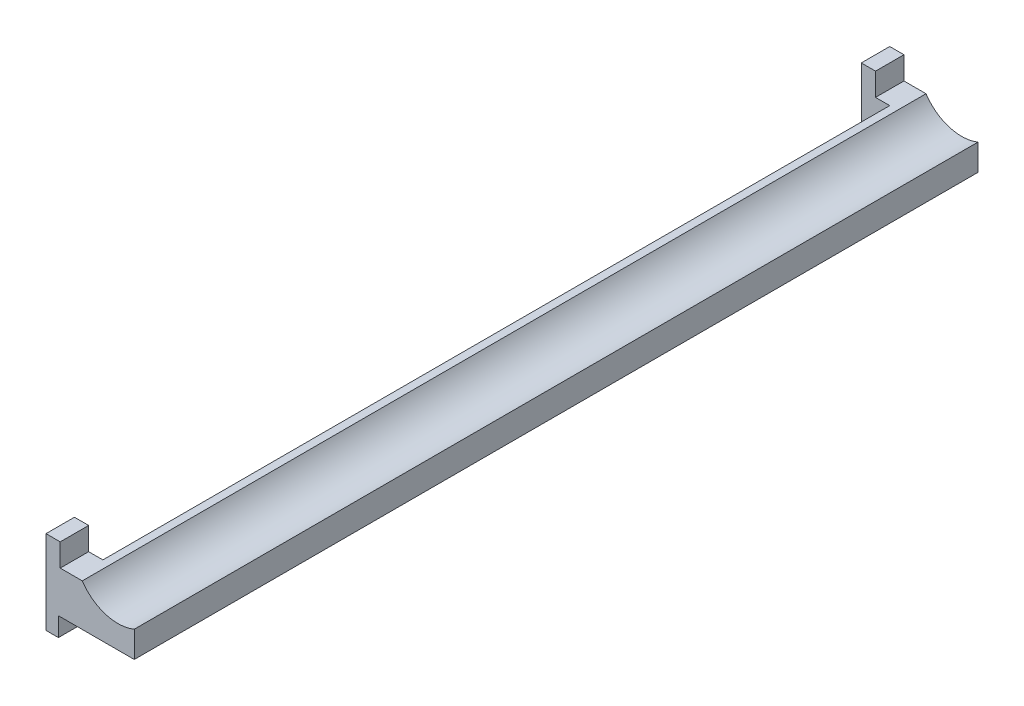
ISO-10303-21;
HEADER;
FILE_DESCRIPTION(('STEP AP214'),'2;1');
FILE_NAME('part.step','',(''),(''),'','','');
FILE_SCHEMA(('AUTOMOTIVE_DESIGN { 1 0 10303 214 1 1 1 1 }'));
ENDSEC;
DATA;
#1=APPLICATION_CONTEXT('core data for automotive mechanical design processes');
#2=APPLICATION_PROTOCOL_DEFINITION('international standard','automotive_design',2000,#1);
#3=PRODUCT_CONTEXT('',#1,'mechanical');
#4=PRODUCT('Part','Part','',(#3));
#5=PRODUCT_RELATED_PRODUCT_CATEGORY('part','',(#4));
#6=PRODUCT_DEFINITION_FORMATION('','',#4);
#7=PRODUCT_DEFINITION_CONTEXT('part definition',#1,'design');
#8=PRODUCT_DEFINITION('design','',#6,#7);
#9=PRODUCT_DEFINITION_SHAPE('','',#8);
#10=(LENGTH_UNIT() NAMED_UNIT(*) SI_UNIT(.MILLI.,.METRE.));
#11=(NAMED_UNIT(*) PLANE_ANGLE_UNIT() SI_UNIT($,.RADIAN.));
#12=(NAMED_UNIT(*) SI_UNIT($,.STERADIAN.) SOLID_ANGLE_UNIT());
#13=UNCERTAINTY_MEASURE_WITH_UNIT(LENGTH_MEASURE(1.E-05),#10,'distance_accuracy_value','');
#14=(GEOMETRIC_REPRESENTATION_CONTEXT(3) GLOBAL_UNCERTAINTY_ASSIGNED_CONTEXT((#13)) GLOBAL_UNIT_ASSIGNED_CONTEXT((#10,
#11,#12)) REPRESENTATION_CONTEXT('',''));
#15=CARTESIAN_POINT('',(0.,0.,0.));
#16=DIRECTION('',(0.,0.,1.));
#17=DIRECTION('',(1.,0.,0.));
#18=AXIS2_PLACEMENT_3D('',#15,#16,#17);
#19=CARTESIAN_POINT('',(187.42,44.22,-890.));
#20=DIRECTION('',(0.,1.,0.));
#21=DIRECTION('',(0.,0.,1.));
#22=AXIS2_PLACEMENT_3D('',#19,#20,#21);
#23=PLANE('',#22);
#24=DIRECTION('',(-1.,0.,0.));
#25=VECTOR('',#24,1.);
#26=CARTESIAN_POINT('',(217.42,44.22,-30.));
#27=LINE('',#26,#25);
#28=CARTESIAN_POINT('',(202.42,44.22,-30.));
#29=VERTEX_POINT('',#28);
#30=CARTESIAN_POINT('',(187.42,44.22,-30.));
#31=VERTEX_POINT('',#30);
#32=EDGE_CURVE('E209',#29,#31,#27,.T.);
#33=ORIENTED_EDGE('',*,*,#32,.T.);
#34=DIRECTION('',(0.,0.,1.));
#35=VECTOR('',#34,1.);
#36=CARTESIAN_POINT('',(187.42,44.22,-890.));
#37=LINE('',#36,#35);
#38=CARTESIAN_POINT('',(187.42,44.22,0.));
#39=VERTEX_POINT('',#38);
#40=EDGE_CURVE('E159',#31,#39,#37,.T.);
#41=ORIENTED_EDGE('',*,*,#40,.T.);
#42=DIRECTION('',(-1.,0.,0.));
#43=VECTOR('',#42,1.);
#44=CARTESIAN_POINT('',(187.42,44.22,0.));
#45=LINE('',#44,#43);
#46=CARTESIAN_POINT('',(202.42,44.22,0.));
#47=VERTEX_POINT('',#46);
#48=EDGE_CURVE('E160',#47,#39,#45,.T.);
#49=ORIENTED_EDGE('',*,*,#48,.F.);
#50=DIRECTION('',(0.,0.,1.));
#51=VECTOR('',#50,1.);
#52=CARTESIAN_POINT('',(202.42,44.22,-890.));
#53=LINE('',#52,#51);
#54=EDGE_CURVE('E96',#29,#47,#53,.T.);
#55=ORIENTED_EDGE('',*,*,#54,.F.);
#56=EDGE_LOOP('',(#33,#41,#49,#55));
#57=FACE_BOUND('',#56,.T.);
#58=ADVANCED_FACE('F36',(#57),#23,.T.);
#59=CARTESIAN_POINT('',(202.42,20.22,-890.));
#60=DIRECTION('',(1.,0.,0.));
#61=DIRECTION('',(0.,0.,-1.));
#62=AXIS2_PLACEMENT_3D('',#59,#60,#61);
#63=PLANE('',#62);
#64=DIRECTION('',(0.,-1.,0.));
#65=VECTOR('',#64,1.);
#66=CARTESIAN_POINT('',(202.42,20.22,-30.));
#67=LINE('',#66,#65);
#68=CARTESIAN_POINT('',(202.42,20.22,-30.));
#69=VERTEX_POINT('',#68);
#70=EDGE_CURVE('E221',#29,#69,#67,.T.);
#71=ORIENTED_EDGE('',*,*,#70,.F.);
#72=ORIENTED_EDGE('',*,*,#54,.T.);
#73=DIRECTION('',(0.,1.,0.));
#74=VECTOR('',#73,1.);
#75=CARTESIAN_POINT('',(202.42,20.22,0.));
#76=LINE('',#75,#74);
#77=CARTESIAN_POINT('',(202.42,20.22,0.));
#78=VERTEX_POINT('',#77);
#79=EDGE_CURVE('E182',#78,#47,#76,.T.);
#80=ORIENTED_EDGE('',*,*,#79,.F.);
#81=DIRECTION('',(0.,0.,1.));
#82=VECTOR('',#81,1.);
#83=CARTESIAN_POINT('',(202.42,20.22,-890.));
#84=LINE('',#83,#82);
#85=EDGE_CURVE('E139',#69,#78,#84,.T.);
#86=ORIENTED_EDGE('',*,*,#85,.F.);
#87=EDGE_LOOP('',(#71,#72,#80,#86));
#88=FACE_BOUND('',#87,.T.);
#89=ADVANCED_FACE('F218',(#88),#63,.T.);
#90=CARTESIAN_POINT('',(200.518812379858,-44.22,-890.));
#91=DIRECTION('',(1.,0.,0.));
#92=DIRECTION('',(0.,0.,-1.));
#93=AXIS2_PLACEMENT_3D('',#90,#91,#92);
#94=PLANE('',#93);
#95=DIRECTION('',(0.,-1.,0.));
#96=VECTOR('',#95,1.);
#97=CARTESIAN_POINT('',(200.518812379858,-44.22,-30.));
#98=LINE('',#97,#96);
#99=CARTESIAN_POINT('',(200.518812379858,-24.22,-30.));
#100=VERTEX_POINT('',#99);
#101=CARTESIAN_POINT('',(200.518812379858,-44.22,-30.));
#102=VERTEX_POINT('',#101);
#103=EDGE_CURVE('E236',#100,#102,#98,.T.);
#104=ORIENTED_EDGE('',*,*,#103,.F.);
#105=DIRECTION('',(0.,0.,1.));
#106=VECTOR('',#105,1.);
#107=CARTESIAN_POINT('',(200.518812379858,-24.22,-890.));
#108=LINE('',#107,#106);
#109=CARTESIAN_POINT('',(200.518812379858,-24.22,0.));
#110=VERTEX_POINT('',#109);
#111=EDGE_CURVE('E195',#100,#110,#108,.T.);
#112=ORIENTED_EDGE('',*,*,#111,.T.);
#113=DIRECTION('',(0.,1.,0.));
#114=VECTOR('',#113,1.);
#115=CARTESIAN_POINT('',(200.518812379858,-44.22,0.));
#116=LINE('',#115,#114);
#117=CARTESIAN_POINT('',(200.518812379858,-44.22,0.));
#118=VERTEX_POINT('',#117);
#119=EDGE_CURVE('E170',#118,#110,#116,.T.);
#120=ORIENTED_EDGE('',*,*,#119,.F.);
#121=DIRECTION('',(0.,0.,1.));
#122=VECTOR('',#121,1.);
#123=CARTESIAN_POINT('',(200.518812379858,-44.22,-890.));
#124=LINE('',#123,#122);
#125=EDGE_CURVE('E199',#102,#118,#124,.T.);
#126=ORIENTED_EDGE('',*,*,#125,.F.);
#127=EDGE_LOOP('',(#104,#112,#120,#126));
#128=FACE_BOUND('',#127,.T.);
#129=ADVANCED_FACE('F298',(#128),#94,.T.);
#130=CARTESIAN_POINT('',(187.42,-44.22,-890.));
#131=DIRECTION('',(0.,-1.,0.));
#132=DIRECTION('',(0.,0.,-1.));
#133=AXIS2_PLACEMENT_3D('',#130,#131,#132);
#134=PLANE('',#133);
#135=DIRECTION('',(-1.,0.,0.));
#136=VECTOR('',#135,1.);
#137=CARTESIAN_POINT('',(217.42,-44.22,-30.));
#138=LINE('',#137,#136);
#139=CARTESIAN_POINT('',(187.42,-44.22,-30.));
#140=VERTEX_POINT('',#139);
#141=EDGE_CURVE('E304',#102,#140,#138,.T.);
#142=ORIENTED_EDGE('',*,*,#141,.F.);
#143=ORIENTED_EDGE('',*,*,#125,.T.);
#144=DIRECTION('',(1.,0.,0.));
#145=VECTOR('',#144,1.);
#146=CARTESIAN_POINT('',(187.42,-44.22,0.));
#147=LINE('',#146,#145);
#148=CARTESIAN_POINT('',(187.42,-44.22,0.));
#149=VERTEX_POINT('',#148);
#150=EDGE_CURVE('E167',#149,#118,#147,.T.);
#151=ORIENTED_EDGE('',*,*,#150,.F.);
#152=DIRECTION('',(0.,0.,1.));
#153=VECTOR('',#152,1.);
#154=CARTESIAN_POINT('',(187.42,-44.22,-890.));
#155=LINE('',#154,#153);
#156=EDGE_CURVE('E202',#140,#149,#155,.T.);
#157=ORIENTED_EDGE('',*,*,#156,.F.);
#158=EDGE_LOOP('',(#142,#143,#151,#157));
#159=FACE_BOUND('',#158,.T.);
#160=ADVANCED_FACE('F302',(#159),#134,.T.);
#161=CARTESIAN_POINT('',(187.42,44.22,-890.));
#162=DIRECTION('',(-1.,0.,0.));
#163=DIRECTION('',(0.,0.,1.));
#164=AXIS2_PLACEMENT_3D('',#161,#162,#163);
#165=PLANE('',#164);
#166=DIRECTION('',(0.,1.,0.));
#167=VECTOR('',#166,1.);
#168=CARTESIAN_POINT('',(187.42,-44.22,-30.));
#169=LINE('',#168,#167);
#170=EDGE_CURVE('E330',#140,#31,#169,.T.);
#171=ORIENTED_EDGE('',*,*,#170,.F.);
#172=ORIENTED_EDGE('',*,*,#156,.T.);
#173=DIRECTION('',(0.,-1.,0.));
#174=VECTOR('',#173,1.);
#175=CARTESIAN_POINT('',(187.42,44.22,0.));
#176=LINE('',#175,#174);
#177=EDGE_CURVE('E163',#39,#149,#176,.T.);
#178=ORIENTED_EDGE('',*,*,#177,.F.);
#179=ORIENTED_EDGE('',*,*,#40,.F.);
#180=EDGE_LOOP('',(#171,#172,#178,#179));
#181=FACE_BOUND('',#180,.T.);
#182=ADVANCED_FACE('F212',(#181),#165,.T.);
#183=DIRECTION('',(-1.,0.,0.));
#184=VECTOR('',#183,1.);
#185=CARTESIAN_POINT('',(217.42,44.22,-860.));
#186=LINE('',#185,#184);
#187=CARTESIAN_POINT('',(202.42,44.22,-860.));
#188=VERTEX_POINT('',#187);
#189=CARTESIAN_POINT('',(187.42,44.22,-860.));
#190=VERTEX_POINT('',#189);
#191=EDGE_CURVE('E51',#188,#190,#186,.T.);
#192=ORIENTED_EDGE('',*,*,#191,.F.);
#193=CARTESIAN_POINT('',(202.42,44.22,-890.));
#194=VERTEX_POINT('',#193);
#195=EDGE_CURVE('E44',#194,#188,#53,.T.);
#196=ORIENTED_EDGE('',*,*,#195,.F.);
#197=DIRECTION('',(-1.,0.,0.));
#198=VECTOR('',#197,1.);
#199=CARTESIAN_POINT('',(187.42,44.22,-890.));
#200=LINE('',#199,#198);
#201=CARTESIAN_POINT('',(187.42,44.22,-890.));
#202=VERTEX_POINT('',#201);
#203=EDGE_CURVE('E185',#194,#202,#200,.T.);
#204=ORIENTED_EDGE('',*,*,#203,.T.);
#205=EDGE_CURVE('E104',#202,#190,#37,.T.);
#206=ORIENTED_EDGE('',*,*,#205,.T.);
#207=EDGE_LOOP('',(#192,#196,#204,#206));
#208=FACE_BOUND('',#207,.T.);
#209=ADVANCED_FACE('F38',(#208),#23,.T.);
#210=DIRECTION('',(0.,1.,0.));
#211=VECTOR('',#210,1.);
#212=CARTESIAN_POINT('',(202.42,20.22,-860.));
#213=LINE('',#212,#211);
#214=CARTESIAN_POINT('',(202.42,20.22,-860.));
#215=VERTEX_POINT('',#214);
#216=EDGE_CURVE('E300',#215,#188,#213,.T.);
#217=ORIENTED_EDGE('',*,*,#216,.F.);
#218=CARTESIAN_POINT('',(202.42,20.22,-890.));
#219=VERTEX_POINT('',#218);
#220=EDGE_CURVE('E187',#219,#215,#84,.T.);
#221=ORIENTED_EDGE('',*,*,#220,.F.);
#222=DIRECTION('',(0.,1.,0.));
#223=VECTOR('',#222,1.);
#224=CARTESIAN_POINT('',(202.42,20.22,-890.));
#225=LINE('',#224,#223);
#226=EDGE_CURVE('E149',#219,#194,#225,.T.);
#227=ORIENTED_EDGE('',*,*,#226,.T.);
#228=ORIENTED_EDGE('',*,*,#195,.T.);
#229=EDGE_LOOP('',(#217,#221,#227,#228));
#230=FACE_BOUND('',#229,.T.);
#231=ADVANCED_FACE('F323',(#230),#63,.T.);
#232=CARTESIAN_POINT('',(225.687364309729,20.22,-890.));
#233=DIRECTION('',(0.,1.,0.));
#234=DIRECTION('',(-1.,0.,0.));
#235=AXIS2_PLACEMENT_3D('',#232,#233,#234);
#236=PLANE('',#235);
#237=DIRECTION('',(1.,0.,0.));
#238=VECTOR('',#237,1.);
#239=CARTESIAN_POINT('',(225.687364309729,20.22,-30.));
#240=LINE('',#239,#238);
#241=CARTESIAN_POINT('',(217.42,20.22,-30.));
#242=VERTEX_POINT('',#241);
#243=EDGE_CURVE('E225',#69,#242,#240,.T.);
#244=ORIENTED_EDGE('',*,*,#243,.F.);
#245=ORIENTED_EDGE('',*,*,#85,.T.);
#246=DIRECTION('',(-1.,0.,0.));
#247=VECTOR('',#246,1.);
#248=CARTESIAN_POINT('',(225.687364309729,20.22,0.));
#249=LINE('',#248,#247);
#250=CARTESIAN_POINT('',(225.687364309729,20.22,0.));
#251=VERTEX_POINT('',#250);
#252=EDGE_CURVE('E134',#251,#78,#249,.T.);
#253=ORIENTED_EDGE('',*,*,#252,.F.);
#254=DIRECTION('',(0.,0.,1.));
#255=VECTOR('',#254,1.);
#256=CARTESIAN_POINT('',(225.687364309729,20.22,-890.));
#257=LINE('',#256,#255);
#258=CARTESIAN_POINT('',(225.687364309729,20.22,-890.));
#259=VERTEX_POINT('',#258);
#260=EDGE_CURVE('E126',#259,#251,#257,.T.);
#261=ORIENTED_EDGE('',*,*,#260,.F.);
#262=DIRECTION('',(-1.,0.,0.));
#263=VECTOR('',#262,1.);
#264=CARTESIAN_POINT('',(225.687364309729,20.22,-890.));
#265=LINE('',#264,#263);
#266=EDGE_CURVE('E131',#259,#219,#265,.T.);
#267=ORIENTED_EDGE('',*,*,#266,.T.);
#268=ORIENTED_EDGE('',*,*,#220,.T.);
#269=DIRECTION('',(-1.,0.,0.));
#270=VECTOR('',#269,1.);
#271=CARTESIAN_POINT('',(225.687364309729,20.22,-860.));
#272=LINE('',#271,#270);
#273=CARTESIAN_POINT('',(217.42,20.22,-860.));
#274=VERTEX_POINT('',#273);
#275=EDGE_CURVE('E315',#274,#215,#272,.T.);
#276=ORIENTED_EDGE('',*,*,#275,.F.);
#277=DIRECTION('',(0.,0.,1.));
#278=VECTOR('',#277,1.);
#279=CARTESIAN_POINT('',(217.42,20.22,-890.));
#280=LINE('',#279,#278);
#281=EDGE_CURVE('E164',#274,#242,#280,.T.);
#282=ORIENTED_EDGE('',*,*,#281,.T.);
#283=EDGE_LOOP('',(#244,#245,#253,#261,#267,#268,#276,#282));
#284=FACE_BOUND('',#283,.T.);
#285=ADVANCED_FACE('F129',(#284),#236,.T.);
#286=CARTESIAN_POINT('',(263.25,45.,-890.));
#287=DIRECTION('',(0.,0.,1.));
#288=DIRECTION('',(1.,0.,0.));
#289=AXIS2_PLACEMENT_3D('',#286,#287,#288);
#290=CYLINDRICAL_SURFACE('',#289,45.0000000000001);
#291=CARTESIAN_POINT('',(263.25,45.,0.));
#292=DIRECTION('',(0.,0.,-1.));
#293=DIRECTION('',(1.,0.,0.));
#294=AXIS2_PLACEMENT_3D('',#291,#292,#293);
#295=CIRCLE('',#294,45.0000000000001);
#296=CARTESIAN_POINT('',(280.518812379858,3.44535983804874,0.));
#297=VERTEX_POINT('',#296);
#298=EDGE_CURVE('E179',#297,#251,#295,.T.);
#299=ORIENTED_EDGE('',*,*,#298,.F.);
#300=DIRECTION('',(0.,0.,1.));
#301=VECTOR('',#300,1.);
#302=CARTESIAN_POINT('',(280.518812379858,3.44535983804874,-890.));
#303=LINE('',#302,#301);
#304=CARTESIAN_POINT('',(280.518812379858,3.44535983804874,-890.));
#305=VERTEX_POINT('',#304);
#306=EDGE_CURVE('E140',#305,#297,#303,.T.);
#307=ORIENTED_EDGE('',*,*,#306,.F.);
#308=CARTESIAN_POINT('',(263.25,45.,-890.));
#309=DIRECTION('',(0.,0.,-1.));
#310=DIRECTION('',(1.,0.,0.));
#311=AXIS2_PLACEMENT_3D('',#308,#309,#310);
#312=CIRCLE('',#311,45.0000000000001);
#313=EDGE_CURVE('E146',#305,#259,#312,.T.);
#314=ORIENTED_EDGE('',*,*,#313,.T.);
#315=ORIENTED_EDGE('',*,*,#260,.T.);
#316=EDGE_LOOP('',(#299,#307,#314,#315));
#317=FACE_BOUND('',#316,.T.);
#318=ADVANCED_FACE('F151',(#317),#290,.F.);
#319=CARTESIAN_POINT('',(280.518812379858,-24.22,-890.));
#320=DIRECTION('',(1.,0.,0.));
#321=DIRECTION('',(0.,0.,-1.));
#322=AXIS2_PLACEMENT_3D('',#319,#320,#321);
#323=PLANE('',#322);
#324=DIRECTION('',(0.,1.,0.));
#325=VECTOR('',#324,1.);
#326=CARTESIAN_POINT('',(280.518812379858,-24.22,0.));
#327=LINE('',#326,#325);
#328=CARTESIAN_POINT('',(280.518812379858,-24.22,0.));
#329=VERTEX_POINT('',#328);
#330=EDGE_CURVE('E176',#329,#297,#327,.T.);
#331=ORIENTED_EDGE('',*,*,#330,.F.);
#332=DIRECTION('',(0.,0.,1.));
#333=VECTOR('',#332,1.);
#334=CARTESIAN_POINT('',(280.518812379858,-24.22,-890.));
#335=LINE('',#334,#333);
#336=CARTESIAN_POINT('',(280.518812379858,-24.22,-890.));
#337=VERTEX_POINT('',#336);
#338=EDGE_CURVE('E190',#337,#329,#335,.T.);
#339=ORIENTED_EDGE('',*,*,#338,.F.);
#340=DIRECTION('',(0.,1.,0.));
#341=VECTOR('',#340,1.);
#342=CARTESIAN_POINT('',(280.518812379858,-24.22,-890.));
#343=LINE('',#342,#341);
#344=EDGE_CURVE('E152',#337,#305,#343,.T.);
#345=ORIENTED_EDGE('',*,*,#344,.T.);
#346=ORIENTED_EDGE('',*,*,#306,.T.);
#347=EDGE_LOOP('',(#331,#339,#345,#346));
#348=FACE_BOUND('',#347,.T.);
#349=ADVANCED_FACE('F371',(#348),#323,.T.);
#350=CARTESIAN_POINT('',(200.518812379858,-24.22,-890.));
#351=DIRECTION('',(0.,-1.,0.));
#352=DIRECTION('',(0.,0.,-1.));
#353=AXIS2_PLACEMENT_3D('',#350,#351,#352);
#354=PLANE('',#353);
#355=DIRECTION('',(-1.,0.,0.));
#356=VECTOR('',#355,1.);
#357=CARTESIAN_POINT('',(200.518812379858,-24.22,-30.));
#358=LINE('',#357,#356);
#359=CARTESIAN_POINT('',(217.42,-24.22,-30.));
#360=VERTEX_POINT('',#359);
#361=EDGE_CURVE('E232',#360,#100,#358,.T.);
#362=ORIENTED_EDGE('',*,*,#361,.F.);
#363=DIRECTION('',(0.,0.,-1.));
#364=VECTOR('',#363,1.);
#365=CARTESIAN_POINT('',(217.42,-24.22,-890.));
#366=LINE('',#365,#364);
#367=CARTESIAN_POINT('',(217.42,-24.22,-860.));
#368=VERTEX_POINT('',#367);
#369=EDGE_CURVE('E11',#360,#368,#366,.T.);
#370=ORIENTED_EDGE('',*,*,#369,.T.);
#371=DIRECTION('',(1.,0.,0.));
#372=VECTOR('',#371,1.);
#373=CARTESIAN_POINT('',(200.518812379858,-24.22,-860.));
#374=LINE('',#373,#372);
#375=CARTESIAN_POINT('',(200.518812379858,-24.22,-860.));
#376=VERTEX_POINT('',#375);
#377=EDGE_CURVE('E313',#376,#368,#374,.T.);
#378=ORIENTED_EDGE('',*,*,#377,.F.);
#379=CARTESIAN_POINT('',(200.518812379858,-24.22,-890.));
#380=VERTEX_POINT('',#379);
#381=EDGE_CURVE('E192',#380,#376,#108,.T.);
#382=ORIENTED_EDGE('',*,*,#381,.F.);
#383=DIRECTION('',(1.,0.,0.));
#384=VECTOR('',#383,1.);
#385=CARTESIAN_POINT('',(200.518812379858,-24.22,-890.));
#386=LINE('',#385,#384);
#387=EDGE_CURVE('E154',#380,#337,#386,.T.);
#388=ORIENTED_EDGE('',*,*,#387,.T.);
#389=ORIENTED_EDGE('',*,*,#338,.T.);
#390=DIRECTION('',(1.,0.,0.));
#391=VECTOR('',#390,1.);
#392=CARTESIAN_POINT('',(200.518812379858,-24.22,0.));
#393=LINE('',#392,#391);
#394=EDGE_CURVE('E173',#110,#329,#393,.T.);
#395=ORIENTED_EDGE('',*,*,#394,.F.);
#396=ORIENTED_EDGE('',*,*,#111,.F.);
#397=EDGE_LOOP('',(#362,#370,#378,#382,#388,#389,#395,#396));
#398=FACE_BOUND('',#397,.T.);
#399=ADVANCED_FACE('F253',(#398),#354,.T.);
#400=DIRECTION('',(0.,1.,0.));
#401=VECTOR('',#400,1.);
#402=CARTESIAN_POINT('',(200.518812379858,-44.22,-860.));
#403=LINE('',#402,#401);
#404=CARTESIAN_POINT('',(200.518812379858,-44.22,-860.));
#405=VERTEX_POINT('',#404);
#406=EDGE_CURVE('E265',#405,#376,#403,.T.);
#407=ORIENTED_EDGE('',*,*,#406,.F.);
#408=CARTESIAN_POINT('',(200.518812379858,-44.22,-890.));
#409=VERTEX_POINT('',#408);
#410=EDGE_CURVE('E196',#409,#405,#124,.T.);
#411=ORIENTED_EDGE('',*,*,#410,.F.);
#412=DIRECTION('',(0.,1.,0.));
#413=VECTOR('',#412,1.);
#414=CARTESIAN_POINT('',(200.518812379858,-44.22,-890.));
#415=LINE('',#414,#413);
#416=EDGE_CURVE('E247',#409,#380,#415,.T.);
#417=ORIENTED_EDGE('',*,*,#416,.T.);
#418=ORIENTED_EDGE('',*,*,#381,.T.);
#419=EDGE_LOOP('',(#407,#411,#417,#418));
#420=FACE_BOUND('',#419,.T.);
#421=ADVANCED_FACE('F261',(#420),#94,.T.);
#422=DIRECTION('',(-1.,0.,0.));
#423=VECTOR('',#422,1.);
#424=CARTESIAN_POINT('',(217.42,-44.22,-860.));
#425=LINE('',#424,#423);
#426=CARTESIAN_POINT('',(187.42,-44.22,-860.));
#427=VERTEX_POINT('',#426);
#428=EDGE_CURVE('E271',#405,#427,#425,.T.);
#429=ORIENTED_EDGE('',*,*,#428,.T.);
#430=CARTESIAN_POINT('',(187.42,-44.22,-890.));
#431=VERTEX_POINT('',#430);
#432=EDGE_CURVE('E200',#431,#427,#155,.T.);
#433=ORIENTED_EDGE('',*,*,#432,.F.);
#434=DIRECTION('',(1.,0.,0.));
#435=VECTOR('',#434,1.);
#436=CARTESIAN_POINT('',(187.42,-44.22,-890.));
#437=LINE('',#436,#435);
#438=EDGE_CURVE('E244',#431,#409,#437,.T.);
#439=ORIENTED_EDGE('',*,*,#438,.T.);
#440=ORIENTED_EDGE('',*,*,#410,.T.);
#441=EDGE_LOOP('',(#429,#433,#439,#440));
#442=FACE_BOUND('',#441,.T.);
#443=ADVANCED_FACE('F268',(#442),#134,.T.);
#444=DIRECTION('',(0.,-1.,0.));
#445=VECTOR('',#444,1.);
#446=CARTESIAN_POINT('',(187.42,44.22,-860.));
#447=LINE('',#446,#445);
#448=EDGE_CURVE('E329',#190,#427,#447,.T.);
#449=ORIENTED_EDGE('',*,*,#448,.F.);
#450=ORIENTED_EDGE('',*,*,#205,.F.);
#451=DIRECTION('',(0.,-1.,0.));
#452=VECTOR('',#451,1.);
#453=CARTESIAN_POINT('',(187.42,44.22,-890.));
#454=LINE('',#453,#452);
#455=EDGE_CURVE('E242',#202,#431,#454,.T.);
#456=ORIENTED_EDGE('',*,*,#455,.T.);
#457=ORIENTED_EDGE('',*,*,#432,.T.);
#458=EDGE_LOOP('',(#449,#450,#456,#457));
#459=FACE_BOUND('',#458,.T.);
#460=ADVANCED_FACE('F353',(#459),#165,.T.);
#461=CARTESIAN_POINT('',(263.25,45.,-890.));
#462=DIRECTION('',(0.,0.,1.));
#463=DIRECTION('',(1.,0.,0.));
#464=AXIS2_PLACEMENT_3D('',#461,#462,#463);
#465=PLANE('',#464);
#466=ORIENTED_EDGE('',*,*,#203,.F.);
#467=ORIENTED_EDGE('',*,*,#226,.F.);
#468=ORIENTED_EDGE('',*,*,#266,.F.);
#469=ORIENTED_EDGE('',*,*,#313,.F.);
#470=ORIENTED_EDGE('',*,*,#344,.F.);
#471=ORIENTED_EDGE('',*,*,#387,.F.);
#472=ORIENTED_EDGE('',*,*,#416,.F.);
#473=ORIENTED_EDGE('',*,*,#438,.F.);
#474=ORIENTED_EDGE('',*,*,#455,.F.);
#475=EDGE_LOOP('',(#466,#467,#468,#469,#470,#471,#472,#473,#474));
#476=FACE_BOUND('',#475,.T.);
#477=ADVANCED_FACE('F144',(#476),#465,.F.);
#478=CARTESIAN_POINT('',(263.25,45.,0.));
#479=DIRECTION('',(0.,0.,1.));
#480=DIRECTION('',(1.,0.,0.));
#481=AXIS2_PLACEMENT_3D('',#478,#479,#480);
#482=PLANE('',#481);
#483=ORIENTED_EDGE('',*,*,#48,.T.);
#484=ORIENTED_EDGE('',*,*,#177,.T.);
#485=ORIENTED_EDGE('',*,*,#150,.T.);
#486=ORIENTED_EDGE('',*,*,#119,.T.);
#487=ORIENTED_EDGE('',*,*,#394,.T.);
#488=ORIENTED_EDGE('',*,*,#330,.T.);
#489=ORIENTED_EDGE('',*,*,#298,.T.);
#490=ORIENTED_EDGE('',*,*,#252,.T.);
#491=ORIENTED_EDGE('',*,*,#79,.T.);
#492=EDGE_LOOP('',(#483,#484,#485,#486,#487,#488,#489,#490,#491));
#493=FACE_BOUND('',#492,.T.);
#494=ADVANCED_FACE('F216',(#493),#482,.T.);
#495=CARTESIAN_POINT('',(217.42,-44.22,-30.));
#496=DIRECTION('',(0.,0.,1.));
#497=DIRECTION('',(1.,0.,0.));
#498=AXIS2_PLACEMENT_3D('',#495,#496,#497);
#499=PLANE('',#498);
#500=ORIENTED_EDGE('',*,*,#70,.T.);
#501=ORIENTED_EDGE('',*,*,#243,.T.);
#502=DIRECTION('',(0.,1.,0.));
#503=VECTOR('',#502,1.);
#504=CARTESIAN_POINT('',(217.42,-44.22,-30.));
#505=LINE('',#504,#503);
#506=EDGE_CURVE('E294',#360,#242,#505,.T.);
#507=ORIENTED_EDGE('',*,*,#506,.F.);
#508=ORIENTED_EDGE('',*,*,#361,.T.);
#509=ORIENTED_EDGE('',*,*,#103,.T.);
#510=ORIENTED_EDGE('',*,*,#141,.T.);
#511=ORIENTED_EDGE('',*,*,#170,.T.);
#512=ORIENTED_EDGE('',*,*,#32,.F.);
#513=EDGE_LOOP('',(#500,#501,#507,#508,#509,#510,#511,#512));
#514=FACE_BOUND('',#513,.T.);
#515=ADVANCED_FACE('F291',(#514),#499,.F.);
#516=CARTESIAN_POINT('',(217.42,44.22,-860.));
#517=DIRECTION('',(0.,0.,-1.));
#518=DIRECTION('',(-1.,0.,0.));
#519=AXIS2_PLACEMENT_3D('',#516,#517,#518);
#520=PLANE('',#519);
#521=ORIENTED_EDGE('',*,*,#216,.T.);
#522=ORIENTED_EDGE('',*,*,#191,.T.);
#523=ORIENTED_EDGE('',*,*,#448,.T.);
#524=ORIENTED_EDGE('',*,*,#428,.F.);
#525=ORIENTED_EDGE('',*,*,#406,.T.);
#526=ORIENTED_EDGE('',*,*,#377,.T.);
#527=DIRECTION('',(0.,-1.,0.));
#528=VECTOR('',#527,1.);
#529=CARTESIAN_POINT('',(217.42,44.22,-860.));
#530=LINE('',#529,#528);
#531=EDGE_CURVE('E332',#274,#368,#530,.T.);
#532=ORIENTED_EDGE('',*,*,#531,.F.);
#533=ORIENTED_EDGE('',*,*,#275,.T.);
#534=EDGE_LOOP('',(#521,#522,#523,#524,#525,#526,#532,#533));
#535=FACE_BOUND('',#534,.T.);
#536=ADVANCED_FACE('F319',(#535),#520,.F.);
#537=CARTESIAN_POINT('',(217.42,0.,0.));
#538=DIRECTION('',(-1.,0.,0.));
#539=DIRECTION('',(0.,0.,1.));
#540=AXIS2_PLACEMENT_3D('',#537,#538,#539);
#541=PLANE('',#540);
#542=ORIENTED_EDGE('',*,*,#531,.T.);
#543=ORIENTED_EDGE('',*,*,#369,.F.);
#544=ORIENTED_EDGE('',*,*,#506,.T.);
#545=ORIENTED_EDGE('',*,*,#281,.F.);
#546=EDGE_LOOP('',(#542,#543,#544,#545));
#547=FACE_BOUND('',#546,.T.);
#548=ADVANCED_FACE('F335',(#547),#541,.T.);
#549=CLOSED_SHELL('',(#58,#89,#129,#160,#182,#209,#231,#285,#318,#349,#399,#421,#443,#460,#477,
#494,#515,#536,#548));
#550=MANIFOLD_SOLID_BREP('B2',#549);
#551=ADVANCED_BREP_SHAPE_REPRESENTATION('',(#18,#550),#14);
#552=SHAPE_DEFINITION_REPRESENTATION(#9,#551);
ENDSEC;
END-ISO-10303-21;
